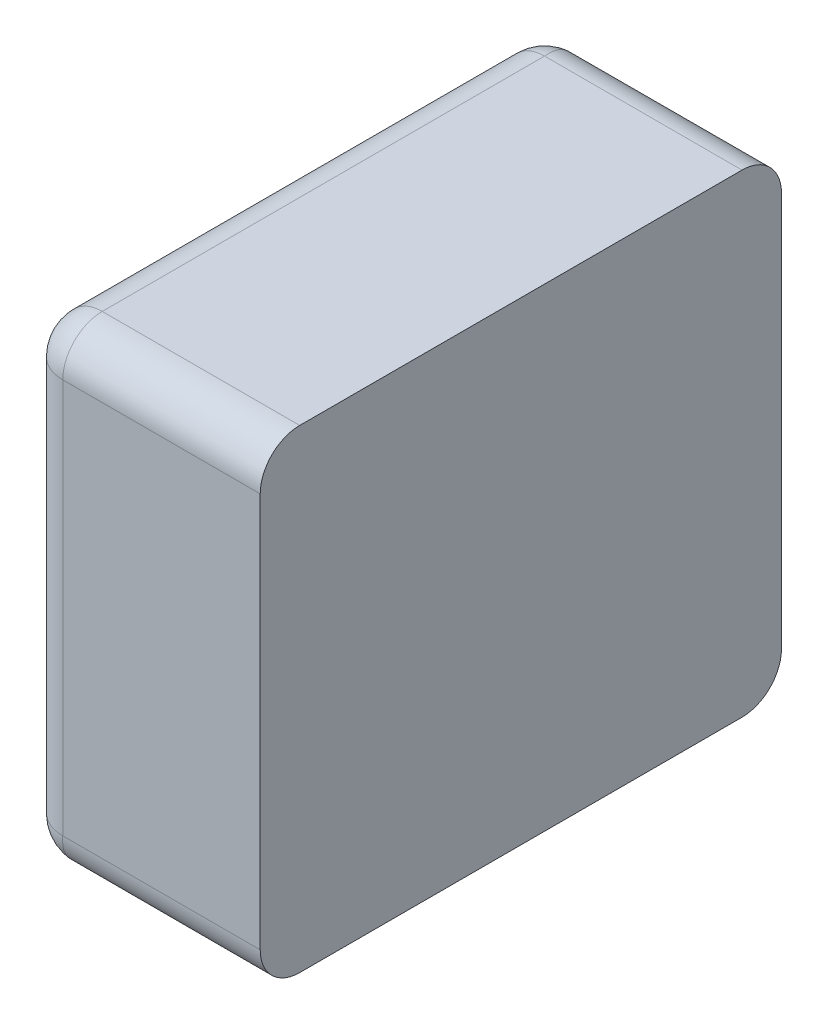
ISO-10303-21;
HEADER;
FILE_DESCRIPTION(('STEP AP214'),'2;1');
FILE_NAME('part.step','',(''),(''),'','','');
FILE_SCHEMA(('AUTOMOTIVE_DESIGN { 1 0 10303 214 1 1 1 1 }'));
ENDSEC;
DATA;
#1=APPLICATION_CONTEXT('core data for automotive mechanical design processes');
#2=APPLICATION_PROTOCOL_DEFINITION('international standard','automotive_design',2000,#1);
#3=PRODUCT_CONTEXT('',#1,'mechanical');
#4=PRODUCT('Part','Part','',(#3));
#5=PRODUCT_RELATED_PRODUCT_CATEGORY('part','',(#4));
#6=PRODUCT_DEFINITION_FORMATION('','',#4);
#7=PRODUCT_DEFINITION_CONTEXT('part definition',#1,'design');
#8=PRODUCT_DEFINITION('design','',#6,#7);
#9=PRODUCT_DEFINITION_SHAPE('','',#8);
#10=(LENGTH_UNIT() NAMED_UNIT(*) SI_UNIT(.MILLI.,.METRE.));
#11=(NAMED_UNIT(*) PLANE_ANGLE_UNIT() SI_UNIT($,.RADIAN.));
#12=(NAMED_UNIT(*) SI_UNIT($,.STERADIAN.) SOLID_ANGLE_UNIT());
#13=UNCERTAINTY_MEASURE_WITH_UNIT(LENGTH_MEASURE(1.E-05),#10,'distance_accuracy_value','');
#14=(GEOMETRIC_REPRESENTATION_CONTEXT(3) GLOBAL_UNCERTAINTY_ASSIGNED_CONTEXT((#13)) GLOBAL_UNIT_ASSIGNED_CONTEXT((#10,
#11,#12)) REPRESENTATION_CONTEXT('',''));
#15=CARTESIAN_POINT('',(0.,0.,0.));
#16=DIRECTION('',(0.,0.,1.));
#17=DIRECTION('',(1.,0.,0.));
#18=AXIS2_PLACEMENT_3D('',#15,#16,#17);
#19=CARTESIAN_POINT('',(-0.275,-0.125,0.025));
#20=DIRECTION('',(-0.816496580927726,0.408248290463864,0.408248290463863));
#21=DIRECTION('',(-0.577350269189626,-0.577350269189627,-0.577350269189625));
#22=AXIS2_PLACEMENT_3D('',#19,#20,#21);
#23=SPHERICAL_SURFACE('',#22,0.025);
#24=CARTESIAN_POINT('',(-0.275,-0.15,0.025));
#25=CARTESIAN_POINT('',(-0.275415676213834,-0.150000010156983,0.0249717616795592));
#26=CARTESIAN_POINT('',(-0.275831055562414,-0.149989585658774,0.0249394158442217));
#27=CARTESIAN_POINT('',(-0.276662012124376,-0.149947847782519,0.0248673044021885));
#28=CARTESIAN_POINT('',(-0.277077581785769,-0.149916440434029,0.0248275059992804));
#29=CARTESIAN_POINT('',(-0.277907618053038,-0.149832548789631,0.0247413826641783));
#30=CARTESIAN_POINT('',(-0.278322073397476,-0.149779979751279,0.0246950319833321));
#31=CARTESIAN_POINT('',(-0.279148608322681,-0.149653686199178,0.0245967395916468));
#32=CARTESIAN_POINT('',(-0.27956067417861,-0.149579886981704,0.0245447785498749));
#33=CARTESIAN_POINT('',(-0.280381173624576,-0.149411146196174,0.0244362356235691));
#34=CARTESIAN_POINT('',(-0.280789592213412,-0.149316140529283,0.0243796400661957));
#35=CARTESIAN_POINT('',(-0.281601566008371,-0.149105097640512,0.0242628279116871));
#36=CARTESIAN_POINT('',(-0.282005106135568,-0.148989007342185,0.0242026024385734));
#37=CARTESIAN_POINT('',(-0.282806120583724,-0.148736002631376,0.0240795539022123));
#38=CARTESIAN_POINT('',(-0.28320358092159,-0.148599046407018,0.0240167258120374));
#39=CARTESIAN_POINT('',(-0.283991266766944,-0.148304614200733,0.0238895132254628));
#40=CARTESIAN_POINT('',(-0.284381480526085,-0.14814710774299,0.023825126535522));
#41=CARTESIAN_POINT('',(-0.285153541708901,-0.14781197565844,0.0236958495945734));
#42=CARTESIAN_POINT('',(-0.285535380708937,-0.147634330792106,0.0236309589181388));
#43=CARTESIAN_POINT('',(-0.286289602430892,-0.147259417678732,0.0235017323758004));
#44=CARTESIAN_POINT('',(-0.286661981083052,-0.147062141159939,0.0234373967562814));
#45=CARTESIAN_POINT('',(-0.287396237536021,-0.146648554189678,0.0233103380435141));
#46=CARTESIAN_POINT('',(-0.287758116578225,-0.146432246000668,0.0232476147597361));
#47=CARTESIAN_POINT('',(-0.288470378199732,-0.145981276798632,0.0231248315859255));
#48=CARTESIAN_POINT('',(-0.288820768206836,-0.145746627988922,0.0230647699658976));
#49=CARTESIAN_POINT('',(-0.289509108460251,-0.14525974785284,0.0229483479675545));
#50=CARTESIAN_POINT('',(-0.289847073104693,-0.14500753792424,0.0228919832419115));
#51=CARTESIAN_POINT('',(-0.290509674749009,-0.144486392144794,0.0227839737435128));
#52=CARTESIAN_POINT('',(-0.290834333801393,-0.144217485995022,0.0227323209712611));
#53=CARTESIAN_POINT('',(-0.291469494627518,-0.143663887304665,0.0226347289227604));
#54=CARTESIAN_POINT('',(-0.291780026684489,-0.143379231742463,0.0225887770211462));
#55=CARTESIAN_POINT('',(-0.292386164695101,-0.142795152921738,0.0225035491754646));
#56=CARTESIAN_POINT('',(-0.29268180962415,-0.14249577276969,0.0224642550853625));
#57=CARTESIAN_POINT('',(-0.293257467637576,-0.141883338445124,0.0223932684780205));
#58=CARTESIAN_POINT('',(-0.293537528729595,-0.14157033224817,0.0223615514954871));
#59=CARTESIAN_POINT('',(-0.294081378390888,-0.14093180991951,0.0223066022870233));
#60=CARTESIAN_POINT('',(-0.294345224212838,-0.140606345279047,0.0222833385908709));
#61=CARTESIAN_POINT('',(-0.294856069398077,-0.139944135618163,0.0222461313306608));
#62=CARTESIAN_POINT('',(-0.295103135339482,-0.139607444174292,0.022232148734625));
#63=CARTESIAN_POINT('',(-0.295579914942669,-0.138924070639427,0.0222142861032459));
#64=CARTESIAN_POINT('',(-0.295809704451679,-0.138577442722618,0.0222103590610882));
#65=CARTESIAN_POINT('',(-0.296251494545238,-0.137875540543628,0.0222133321433696));
#66=CARTESIAN_POINT('',(-0.296463580049632,-0.137520319530238,0.0222201770304482));
#67=CARTESIAN_POINT('',(-0.296869595417803,-0.136802624092122,0.0222453561781187));
#68=CARTESIAN_POINT('',(-0.297063618935002,-0.136440200456916,0.0222636268844006));
#69=CARTESIAN_POINT('',(-0.297433213963008,-0.135709535228763,0.0223122531890844));
#70=CARTESIAN_POINT('',(-0.297608887378239,-0.135341340447619,0.0223425370092373));
#71=CARTESIAN_POINT('',(-0.297941556355398,-0.134600604173974,0.0224157145335039));
#72=CARTESIAN_POINT('',(-0.298098661446718,-0.134228104043934,0.0224585285146415));
#73=CARTESIAN_POINT('',(-0.298394038077466,-0.133480258519227,0.0225572169437126));
#74=CARTESIAN_POINT('',(-0.298532426005439,-0.133104947635931,0.0226130041963119));
#75=CARTESIAN_POINT('',(-0.298790282913471,-0.132353001463475,0.0227380133503036));
#76=CARTESIAN_POINT('',(-0.298909874234575,-0.131976392569098,0.0228071412404509));
#77=CARTESIAN_POINT('',(-0.299130119595873,-0.131223398192717,0.0229591223007916));
#78=CARTESIAN_POINT('',(-0.299230900910104,-0.130847029768722,0.0230418755188332));
#79=CARTESIAN_POINT('',(-0.299413582847159,-0.130096030213761,0.0232213281368203));
#80=CARTESIAN_POINT('',(-0.299495614474251,-0.129721406146137,0.0233179225843271));
#81=CARTESIAN_POINT('',(-0.299604779367685,-0.12916097275375,0.0234736338151954));
#82=CARTESIAN_POINT('',(-0.299638780077472,-0.128974916302159,0.0235271805591116));
#83=CARTESIAN_POINT('',(-0.29970212944545,-0.128603818714183,0.0236377844166513));
#84=CARTESIAN_POINT('',(-0.29973149488389,-0.128418776370976,0.0236948277794382));
#85=CARTESIAN_POINT('',(-0.299785596680384,-0.12804990634783,0.0238124252593363));
#86=CARTESIAN_POINT('',(-0.299810349876557,-0.127866076710932,0.023872965505361));
#87=CARTESIAN_POINT('',(-0.299855256493048,-0.12749982091122,0.0239975539979947));
#88=CARTESIAN_POINT('',(-0.299875426755908,-0.127317392070842,0.0240615882907726));
#89=CARTESIAN_POINT('',(-0.299911199948112,-0.126954128152848,0.0241931561571548));
#90=CARTESIAN_POINT('',(-0.299926819681761,-0.126773289666063,0.0242606757436093));
#91=CARTESIAN_POINT('',(-0.299953528249625,-0.126413394821305,0.0243992001051096));
#92=CARTESIAN_POINT('',(-0.299964633803205,-0.126234334328419,0.0244701909080881));
#93=CARTESIAN_POINT('',(-0.299982353760455,-0.125878182225797,0.0246156386140871));
#94=CARTESIAN_POINT('',(-0.299988984753714,-0.125701085764511,0.0246900816080177));
#95=CARTESIAN_POINT('',(-0.299997800037759,-0.125349047666083,0.0248424075130586));
#96=CARTESIAN_POINT('',(-0.300000000737951,-0.125174100471466,0.0249202766343398));
#97=CARTESIAN_POINT('',(-0.3,-0.125,0.025));
#98=B_SPLINE_CURVE_WITH_KNOTS('',3,(#24,#25,#26,#27,#28,#29,#30,#31,#32,#33,#34,#35,#36,#37,#38,
#39,#40,#41,#42,#43,#44,#45,#46,#47,#48,#49,#50,#51,#52,#53,#54,#55,#56,#57,#58,#59,#60,#61,#62,
#63,#64,#65,#66,#67,#68,#69,#70,#71,#72,#73,#74,#75,#76,#77,#78,#79,#80,#81,#82,#83,#84,#85,#86,
#87,#88,#89,#90,#91,#92,#93,#94,#95,#96,#97),.UNSPECIFIED.,.F.,.F.,(4,2,2,2,2,2,2,2,2,2,2,2,2,2,
2,2,2,2,2,2,2,2,2,2,2,2,2,2,2,2,2,2,2,2,2,2,4),(0.,0.00124972674914432,0.00250508818118087,
0.00376552755498708,0.00503045751811205,0.00629926393006435,0.00757130973543098,
0.00884593887638394,0.0101224802356455,0.0114002516022038,0.0126785636530195,0.0139567239446433,
0.0152340409091005,0.0165098278485827,0.0177834069234384,0.0190541131276553,0.0203212982454897,
0.0215843347821013,0.0228426198599832,0.0240955790716335,0.0253426702772639,0.0265833873343772,
0.0278172637437544,0.0290438761937642,0.0302628479819392,0.0314738522894821,0.0326766152807867,
0.0338709189962571,0.0350566040027588,0.0356462463463342,0.0362337025741548,0.0368189702268576,
0.0374020508853401,0.0379829502134117,0.0385616779934515,0.0391382481546671,0.0397126787935412),.UNSPECIFIED.);
#99=CARTESIAN_POINT('',(-0.275,-0.15,0.025));
#100=VERTEX_POINT('',#99);
#101=CARTESIAN_POINT('',(-0.3,-0.125,0.025));
#102=VERTEX_POINT('',#101);
#103=EDGE_CURVE('E11',#100,#102,#98,.T.);
#104=ORIENTED_EDGE('',*,*,#103,.T.);
#105=CARTESIAN_POINT('',(-0.275,-0.125,0.025));
#106=DIRECTION('',(0.,-1.,0.));
#107=DIRECTION('',(0.,0.,-1.));
#108=AXIS2_PLACEMENT_3D('',#105,#106,#107);
#109=CIRCLE('',#108,0.025);
#110=CARTESIAN_POINT('',(-0.275,-0.125,0.));
#111=VERTEX_POINT('',#110);
#112=EDGE_CURVE('E25',#102,#111,#109,.T.);
#113=ORIENTED_EDGE('',*,*,#112,.T.);
#114=CARTESIAN_POINT('',(-0.275,-0.125,0.025));
#115=DIRECTION('',(-1.,0.,0.));
#116=DIRECTION('',(0.,-1.,0.));
#117=AXIS2_PLACEMENT_3D('',#114,#115,#116);
#118=CIRCLE('',#117,0.025);
#119=EDGE_CURVE('E109',#111,#100,#118,.T.);
#120=ORIENTED_EDGE('',*,*,#119,.T.);
#121=EDGE_LOOP('',(#104,#113,#120));
#122=FACE_BOUND('',#121,.T.);
#123=ADVANCED_FACE('F17',(#122),#23,.T.);
#124=CARTESIAN_POINT('',(-0.275,0.125,0.025));
#125=DIRECTION('',(0.408248290463864,-0.408248290463863,-0.816496580927726));
#126=DIRECTION('',(-0.577350269189627,0.577350269189625,-0.577350269189626));
#127=AXIS2_PLACEMENT_3D('',#124,#125,#126);
#128=SPHERICAL_SURFACE('',#127,0.025);
#129=CARTESIAN_POINT('',(-0.275,0.125,0.025));
#130=DIRECTION('',(0.,0.,-1.));
#131=DIRECTION('',(0.,1.,0.));
#132=AXIS2_PLACEMENT_3D('',#129,#130,#131);
#133=CIRCLE('',#132,0.025);
#134=CARTESIAN_POINT('',(-0.3,0.125,0.025));
#135=VERTEX_POINT('',#134);
#136=CARTESIAN_POINT('',(-0.275,0.15,0.025));
#137=VERTEX_POINT('',#136);
#138=EDGE_CURVE('E227',#135,#137,#133,.T.);
#139=ORIENTED_EDGE('',*,*,#138,.T.);
#140=CARTESIAN_POINT('',(-0.275,0.15,0.025));
#141=CARTESIAN_POINT('',(-0.275028238320441,0.150000010156983,0.0245843237861664));
#142=CARTESIAN_POINT('',(-0.275060584155778,0.149989585658774,0.0241689444375859));
#143=CARTESIAN_POINT('',(-0.275132695597812,0.149947847782519,0.0233379878756242));
#144=CARTESIAN_POINT('',(-0.27517249400072,0.149916440434029,0.0229224182142309));
#145=CARTESIAN_POINT('',(-0.275258617335822,0.149832548789631,0.0220923819469617));
#146=CARTESIAN_POINT('',(-0.275304968016668,0.149779979751279,0.0216779266025236));
#147=CARTESIAN_POINT('',(-0.275403260408353,0.149653686199178,0.0208513916773187));
#148=CARTESIAN_POINT('',(-0.275455221450125,0.149579886981704,0.0204393258213897));
#149=CARTESIAN_POINT('',(-0.275563764376431,0.149411146196174,0.0196188263754239));
#150=CARTESIAN_POINT('',(-0.275620359933804,0.149316140529283,0.0192104077865878));
#151=CARTESIAN_POINT('',(-0.275737172088313,0.149105097640512,0.0183984339916287));
#152=CARTESIAN_POINT('',(-0.275797397561427,0.148989007342185,0.0179948938644317));
#153=CARTESIAN_POINT('',(-0.275920446097788,0.148736002631376,0.0171938794162764));
#154=CARTESIAN_POINT('',(-0.275983274187963,0.148599046407018,0.0167964190784103));
#155=CARTESIAN_POINT('',(-0.276110486774537,0.148304614200733,0.0160087332330562));
#156=CARTESIAN_POINT('',(-0.276174873464478,0.14814710774299,0.0156185194739151));
#157=CARTESIAN_POINT('',(-0.276304150405427,0.14781197565844,0.0148464582910993));
#158=CARTESIAN_POINT('',(-0.276369041081861,0.147634330792106,0.0144646192910634));
#159=CARTESIAN_POINT('',(-0.2764982676242,0.147259417678732,0.0137103975691083));
#160=CARTESIAN_POINT('',(-0.276562603243719,0.147062141159939,0.013338018916948));
#161=CARTESIAN_POINT('',(-0.276689661956486,0.146648554189678,0.0126037624639793));
#162=CARTESIAN_POINT('',(-0.276752385240264,0.146432246000668,0.0122418834217749));
#163=CARTESIAN_POINT('',(-0.276875168414075,0.145981276798632,0.0115296218002681));
#164=CARTESIAN_POINT('',(-0.276935230034102,0.145746627988922,0.0111792317931642));
#165=CARTESIAN_POINT('',(-0.277051652032446,0.14525974785284,0.0104908915397485));
#166=CARTESIAN_POINT('',(-0.277108016758089,0.14500753792424,0.0101529268953074));
#167=CARTESIAN_POINT('',(-0.277216026256487,0.144486392144794,0.00949032525099112));
#168=CARTESIAN_POINT('',(-0.277267679028739,0.144217485995022,0.00916566619860705));
#169=CARTESIAN_POINT('',(-0.27736527107724,0.143663887304665,0.00853050537248187));
#170=CARTESIAN_POINT('',(-0.277411222978854,0.143379231742463,0.00821997331551061));
#171=CARTESIAN_POINT('',(-0.277496450824535,0.142795152921738,0.00761383530489926));
#172=CARTESIAN_POINT('',(-0.277535744914638,0.14249577276969,0.0073181903758499));
#173=CARTESIAN_POINT('',(-0.27760673152198,0.141883338445124,0.00674253236242435));
#174=CARTESIAN_POINT('',(-0.277638448504513,0.14157033224817,0.00646247127040547));
#175=CARTESIAN_POINT('',(-0.277693397712977,0.14093180991951,0.00591862160911195));
#176=CARTESIAN_POINT('',(-0.277716661409129,0.140606345279047,0.00565477578716186));
#177=CARTESIAN_POINT('',(-0.277753868669339,0.139944135618163,0.00514393060192284));
#178=CARTESIAN_POINT('',(-0.277767851265375,0.139607444174292,0.00489686466051837));
#179=CARTESIAN_POINT('',(-0.277785713896754,0.138924070639427,0.00442008505733056));
#180=CARTESIAN_POINT('',(-0.277789640938912,0.138577442722617,0.00419029554832144));
#181=CARTESIAN_POINT('',(-0.27778666785663,0.137875540543628,0.00374850545476184));
#182=CARTESIAN_POINT('',(-0.277779822969552,0.137520319530238,0.00353641995036835));
#183=CARTESIAN_POINT('',(-0.277754643821881,0.136802624092122,0.00313040458219718));
#184=CARTESIAN_POINT('',(-0.277736373115599,0.136440200456916,0.00293638106499816));
#185=CARTESIAN_POINT('',(-0.277687746810916,0.135709535228763,0.00256678603699146));
#186=CARTESIAN_POINT('',(-0.277657462990763,0.135341340447619,0.00239111262176079));
#187=CARTESIAN_POINT('',(-0.277584285466496,0.134600604173974,0.00205844364460159));
#188=CARTESIAN_POINT('',(-0.277541471485359,0.134228104043934,0.00190133855328219));
#189=CARTESIAN_POINT('',(-0.277442783056288,0.133480258519227,0.00160596192253449));
#190=CARTESIAN_POINT('',(-0.277386995803688,0.133104947635931,0.00146757399456146));
#191=CARTESIAN_POINT('',(-0.277261986649696,0.132353001463475,0.00120971708652909));
#192=CARTESIAN_POINT('',(-0.277192858759549,0.131976392569098,0.00109012576542486));
#193=CARTESIAN_POINT('',(-0.277040877699208,0.131223398192717,0.000869880404126535));
#194=CARTESIAN_POINT('',(-0.276958124481167,0.130847029768722,0.000769099089895567));
#195=CARTESIAN_POINT('',(-0.27677867186318,0.130096030213761,0.000586417152841505));
#196=CARTESIAN_POINT('',(-0.276682077415673,0.129721406146137,0.00050438552574881));
#197=CARTESIAN_POINT('',(-0.276526366184805,0.12916097275375,0.000395220632315162));
#198=CARTESIAN_POINT('',(-0.276472819440888,0.128974916302159,0.000361219922528354));
#199=CARTESIAN_POINT('',(-0.276362215583349,0.128603818714183,0.000297870554549847));
#200=CARTESIAN_POINT('',(-0.276305172220562,0.128418776370976,0.000268505116110418));
#201=CARTESIAN_POINT('',(-0.276187574740664,0.12804990634783,0.00021440331961602));
#202=CARTESIAN_POINT('',(-0.276127034494639,0.127866076710932,0.000189650123443174));
#203=CARTESIAN_POINT('',(-0.276002446002005,0.12749982091122,0.000144743506951797));
#204=CARTESIAN_POINT('',(-0.275938411709227,0.127317392070842,0.00012457324409247));
#205=CARTESIAN_POINT('',(-0.275806843842845,0.126954128152848,8.8800051888205E-05));
#206=CARTESIAN_POINT('',(-0.275739324256391,0.126773289666063,7.3180318238639E-05));
#207=CARTESIAN_POINT('',(-0.27560079989489,0.126413394821305,4.64717503746717E-05));
#208=CARTESIAN_POINT('',(-0.275529809091912,0.126234334328419,3.5366196795129E-05));
#209=CARTESIAN_POINT('',(-0.275384361385913,0.125878182225797,1.76462395452149E-05));
#210=CARTESIAN_POINT('',(-0.275309918391982,0.125701085764511,1.10152462860655E-05));
#211=CARTESIAN_POINT('',(-0.275157592486941,0.125349047666083,2.19996224107495E-06));
#212=CARTESIAN_POINT('',(-0.27507972336566,0.125174100471466,-7.3795088351577E-10));
#213=CARTESIAN_POINT('',(-0.275,0.125,0.));
#214=B_SPLINE_CURVE_WITH_KNOTS('',3,(#140,#141,#142,#143,#144,#145,#146,#147,#148,#149,#150,
#151,#152,#153,#154,#155,#156,#157,#158,#159,#160,#161,#162,#163,#164,#165,#166,#167,#168,#169,
#170,#171,#172,#173,#174,#175,#176,#177,#178,#179,#180,#181,#182,#183,#184,#185,#186,#187,#188,
#189,#190,#191,#192,#193,#194,#195,#196,#197,#198,#199,#200,#201,#202,#203,#204,#205,#206,#207,
#208,#209,#210,#211,#212,#213),.UNSPECIFIED.,.F.,.F.,(4,2,2,2,2,2,2,2,2,2,2,2,2,2,2,2,2,2,2,2,2,
2,2,2,2,2,2,2,2,2,2,2,2,2,2,2,4),(0.,0.00124972674914428,0.00250508818118087,
0.00376552755498708,0.00503045751811209,0.00629926393006442,0.00757130973543103,
0.008845938876384,0.0101224802356455,0.0114002516022038,0.0126785636530195,0.0139567239446434,
0.0152340409091005,0.0165098278485827,0.0177834069234385,0.0190541131276553,0.0203212982454898,
0.0215843347821014,0.0228426198599832,0.0240955790716335,0.025342670277264,0.0265833873343772,
0.0278172637437544,0.0290438761937642,0.0302628479819393,0.0314738522894822,0.0326766152807867,
0.0338709189962572,0.0350566040027589,0.0356462463463343,0.0362337025741548,0.0368189702268576,
0.0374020508853402,0.0379829502134118,0.0385616779934515,0.0391382481546671,0.0397126787935412),.UNSPECIFIED.);
#215=CARTESIAN_POINT('',(-0.275,0.125,0.));
#216=VERTEX_POINT('',#215);
#217=EDGE_CURVE('E231',#137,#216,#214,.T.);
#218=ORIENTED_EDGE('',*,*,#217,.T.);
#219=CARTESIAN_POINT('',(-0.275,0.125,0.025));
#220=DIRECTION('',(0.,1.,0.));
#221=DIRECTION('',(-1.,0.,0.));
#222=AXIS2_PLACEMENT_3D('',#219,#220,#221);
#223=CIRCLE('',#222,0.025);
#224=EDGE_CURVE('E260',#216,#135,#223,.T.);
#225=ORIENTED_EDGE('',*,*,#224,.T.);
#226=EDGE_LOOP('',(#139,#218,#225));
#227=FACE_BOUND('',#226,.T.);
#228=ADVANCED_FACE('F243',(#227),#128,.T.);
#229=CARTESIAN_POINT('',(-0.1875,0.125,0.025));
#230=DIRECTION('',(-1.,0.,0.));
#231=DIRECTION('',(0.,0.707106781186548,-0.707106781186547));
#232=AXIS2_PLACEMENT_3D('',#229,#230,#231);
#233=CYLINDRICAL_SURFACE('',#232,0.025);
#234=CARTESIAN_POINT('',(-0.15,0.125,0.025));
#235=DIRECTION('',(-1.,0.,0.));
#236=DIRECTION('',(0.,0.707106781186548,-0.707106781186547));
#237=AXIS2_PLACEMENT_3D('',#234,#235,#236);
#238=CIRCLE('',#237,0.025);
#239=CARTESIAN_POINT('',(-0.15,0.15,0.025));
#240=VERTEX_POINT('',#239);
#241=CARTESIAN_POINT('',(-0.15,0.125,0.));
#242=VERTEX_POINT('',#241);
#243=EDGE_CURVE('E267',#240,#242,#238,.T.);
#244=ORIENTED_EDGE('',*,*,#243,.T.);
#245=DIRECTION('',(-1.,0.,0.));
#246=VECTOR('',#245,1.);
#247=CARTESIAN_POINT('',(-0.1875,0.125,0.));
#248=LINE('',#247,#246);
#249=EDGE_CURVE('E118',#242,#216,#248,.T.);
#250=ORIENTED_EDGE('',*,*,#249,.T.);
#251=ORIENTED_EDGE('',*,*,#217,.F.);
#252=DIRECTION('',(1.,0.,0.));
#253=VECTOR('',#252,1.);
#254=CARTESIAN_POINT('',(-0.1875,0.15,0.025));
#255=LINE('',#254,#253);
#256=EDGE_CURVE('E272',#137,#240,#255,.T.);
#257=ORIENTED_EDGE('',*,*,#256,.T.);
#258=EDGE_LOOP('',(#244,#250,#251,#257));
#259=FACE_BOUND('',#258,.T.);
#260=ADVANCED_FACE('F252',(#259),#233,.T.);
#261=CARTESIAN_POINT('',(-0.275,0.0749999999999998,0.025));
#262=DIRECTION('',(0.,-1.,0.));
#263=DIRECTION('',(-0.707106781186548,0.,-0.707106781186547));
#264=AXIS2_PLACEMENT_3D('',#261,#262,#263);
#265=CYLINDRICAL_SURFACE('',#264,0.025);
#266=ORIENTED_EDGE('',*,*,#112,.F.);
#267=DIRECTION('',(0.,1.,0.));
#268=VECTOR('',#267,1.);
#269=CARTESIAN_POINT('',(-0.3,0.0749999999999998,0.025));
#270=LINE('',#269,#268);
#271=EDGE_CURVE('E277',#102,#135,#270,.T.);
#272=ORIENTED_EDGE('',*,*,#271,.T.);
#273=ORIENTED_EDGE('',*,*,#224,.F.);
#274=DIRECTION('',(0.,-1.,0.));
#275=VECTOR('',#274,1.);
#276=CARTESIAN_POINT('',(-0.275,0.0749999999999998,0.));
#277=LINE('',#276,#275);
#278=EDGE_CURVE('E282',#216,#111,#277,.T.);
#279=ORIENTED_EDGE('',*,*,#278,.T.);
#280=EDGE_LOOP('',(#266,#272,#273,#279));
#281=FACE_BOUND('',#280,.T.);
#282=ADVANCED_FACE('F255',(#281),#265,.T.);
#283=CARTESIAN_POINT('',(-0.275,-0.125,0.305));
#284=DIRECTION('',(0.408248290463862,-0.816496580927727,-0.408248290463862));
#285=DIRECTION('',(-0.577350269189627,-0.577350269189624,0.577350269189627));
#286=AXIS2_PLACEMENT_3D('',#283,#284,#285);
#287=SPHERICAL_SURFACE('',#286,0.025);
#288=CARTESIAN_POINT('',(-0.275,-0.125,0.305));
#289=DIRECTION('',(0.,-1.,0.));
#290=DIRECTION('',(-1.,0.,0.));
#291=AXIS2_PLACEMENT_3D('',#288,#289,#290);
#292=CIRCLE('',#291,0.025);
#293=CARTESIAN_POINT('',(-0.275,-0.125,0.33));
#294=VERTEX_POINT('',#293);
#295=CARTESIAN_POINT('',(-0.3,-0.125,0.305));
#296=VERTEX_POINT('',#295);
#297=EDGE_CURVE('E286',#294,#296,#292,.T.);
#298=ORIENTED_EDGE('',*,*,#297,.T.);
#299=CARTESIAN_POINT('',(-0.275,-0.125,0.305));
#300=DIRECTION('',(0.,0.,1.));
#301=DIRECTION('',(0.,-1.,0.));
#302=AXIS2_PLACEMENT_3D('',#299,#300,#301);
#303=CIRCLE('',#302,0.025);
#304=CARTESIAN_POINT('',(-0.275,-0.15,0.305));
#305=VERTEX_POINT('',#304);
#306=EDGE_CURVE('E290',#296,#305,#303,.T.);
#307=ORIENTED_EDGE('',*,*,#306,.T.);
#308=CARTESIAN_POINT('',(-0.275,-0.15,0.305));
#309=CARTESIAN_POINT('',(-0.27507972336566,-0.150000000737951,0.305174100471466));
#310=CARTESIAN_POINT('',(-0.275157592486941,-0.149997800037759,0.305349047666083));
#311=CARTESIAN_POINT('',(-0.275309918391982,-0.149988984753714,0.30570108576451));
#312=CARTESIAN_POINT('',(-0.275384361385913,-0.149982353760455,0.305878182225797));
#313=CARTESIAN_POINT('',(-0.275529809091912,-0.149964633803205,0.306234334328419));
#314=CARTESIAN_POINT('',(-0.27560079989489,-0.149953528249625,0.306413394821305));
#315=CARTESIAN_POINT('',(-0.275739324256391,-0.149926819681761,0.306773289666062));
#316=CARTESIAN_POINT('',(-0.275806843842845,-0.149911199948112,0.306954128152848));
#317=CARTESIAN_POINT('',(-0.275938411709227,-0.149875426755908,0.307317392070842));
#318=CARTESIAN_POINT('',(-0.276002446002005,-0.149855256493048,0.30749982091122));
#319=CARTESIAN_POINT('',(-0.276127034494639,-0.149810349876557,0.307866076710932));
#320=CARTESIAN_POINT('',(-0.276187574740664,-0.149785596680384,0.30804990634783));
#321=CARTESIAN_POINT('',(-0.276305172220562,-0.14973149488389,0.308418776370976));
#322=CARTESIAN_POINT('',(-0.276362215583349,-0.14970212944545,0.308603818714183));
#323=CARTESIAN_POINT('',(-0.276472819440888,-0.149638780077472,0.308974916302159));
#324=CARTESIAN_POINT('',(-0.276526366184805,-0.149604779367685,0.30916097275375));
#325=CARTESIAN_POINT('',(-0.276682077415673,-0.149495614474251,0.309721406146137));
#326=CARTESIAN_POINT('',(-0.27677867186318,-0.149413582847159,0.310096030213761));
#327=CARTESIAN_POINT('',(-0.276958124481167,-0.149230900910104,0.310847029768722));
#328=CARTESIAN_POINT('',(-0.277040877699208,-0.149130119595873,0.311223398192717));
#329=CARTESIAN_POINT('',(-0.277192858759549,-0.148909874234575,0.311976392569098));
#330=CARTESIAN_POINT('',(-0.277261986649696,-0.148790282913471,0.312353001463475));
#331=CARTESIAN_POINT('',(-0.277386995803688,-0.148532426005439,0.313104947635931));
#332=CARTESIAN_POINT('',(-0.277442783056288,-0.148394038077466,0.313480258519227));
#333=CARTESIAN_POINT('',(-0.277541471485359,-0.148098661446718,0.314228104043934));
#334=CARTESIAN_POINT('',(-0.277584285466496,-0.147941556355398,0.314600604173974));
#335=CARTESIAN_POINT('',(-0.277657462990763,-0.147608887378239,0.315341340447619));
#336=CARTESIAN_POINT('',(-0.277687746810916,-0.147433213963009,0.315709535228763));
#337=CARTESIAN_POINT('',(-0.277736373115599,-0.147063618935002,0.316440200456916));
#338=CARTESIAN_POINT('',(-0.277754643821881,-0.146869595417803,0.316802624092122));
#339=CARTESIAN_POINT('',(-0.277779822969552,-0.146463580049632,0.317520319530238));
#340=CARTESIAN_POINT('',(-0.27778666785663,-0.146251494545238,0.317875540543628));
#341=CARTESIAN_POINT('',(-0.277789640938912,-0.145809704451679,0.318577442722617));
#342=CARTESIAN_POINT('',(-0.277785713896754,-0.145579914942669,0.318924070639427));
#343=CARTESIAN_POINT('',(-0.277767851265375,-0.145103135339482,0.319607444174292));
#344=CARTESIAN_POINT('',(-0.277753868669339,-0.144856069398077,0.319944135618163));
#345=CARTESIAN_POINT('',(-0.277716661409129,-0.144345224212838,0.320606345279046));
#346=CARTESIAN_POINT('',(-0.277693397712977,-0.144081378390888,0.32093180991951));
#347=CARTESIAN_POINT('',(-0.277638448504513,-0.143537528729595,0.32157033224817));
#348=CARTESIAN_POINT('',(-0.27760673152198,-0.143257467637576,0.321883338445124));
#349=CARTESIAN_POINT('',(-0.277535744914638,-0.14268180962415,0.32249577276969));
#350=CARTESIAN_POINT('',(-0.277496450824535,-0.142386164695101,0.322795152921738));
#351=CARTESIAN_POINT('',(-0.277411222978854,-0.141780026684489,0.323379231742463));
#352=CARTESIAN_POINT('',(-0.27736527107724,-0.141469494627518,0.323663887304665));
#353=CARTESIAN_POINT('',(-0.277267679028739,-0.140834333801393,0.324217485995022));
#354=CARTESIAN_POINT('',(-0.277216026256487,-0.140509674749009,0.324486392144794));
#355=CARTESIAN_POINT('',(-0.277108016758089,-0.139847073104693,0.32500753792424));
#356=CARTESIAN_POINT('',(-0.277051652032446,-0.139509108460252,0.32525974785284));
#357=CARTESIAN_POINT('',(-0.276935230034102,-0.138820768206836,0.325746627988922));
#358=CARTESIAN_POINT('',(-0.276875168414075,-0.138470378199732,0.325981276798632));
#359=CARTESIAN_POINT('',(-0.276752385240264,-0.137758116578225,0.326432246000668));
#360=CARTESIAN_POINT('',(-0.276689661956486,-0.137396237536021,0.326648554189678));
#361=CARTESIAN_POINT('',(-0.276562603243719,-0.136661981083052,0.327062141159939));
#362=CARTESIAN_POINT('',(-0.2764982676242,-0.136289602430892,0.327259417678732));
#363=CARTESIAN_POINT('',(-0.276369041081861,-0.135535380708937,0.327634330792106));
#364=CARTESIAN_POINT('',(-0.276304150405427,-0.135153541708901,0.32781197565844));
#365=CARTESIAN_POINT('',(-0.276174873464478,-0.134381480526085,0.32814710774299));
#366=CARTESIAN_POINT('',(-0.276110486774537,-0.133991266766944,0.328304614200733));
#367=CARTESIAN_POINT('',(-0.275983274187963,-0.13320358092159,0.328599046407018));
#368=CARTESIAN_POINT('',(-0.275920446097788,-0.132806120583724,0.328736002631376));
#369=CARTESIAN_POINT('',(-0.275797397561427,-0.132005106135568,0.328989007342185));
#370=CARTESIAN_POINT('',(-0.275737172088313,-0.131601566008371,0.329105097640512));
#371=CARTESIAN_POINT('',(-0.275620359933804,-0.130789592213412,0.329316140529283));
#372=CARTESIAN_POINT('',(-0.275563764376431,-0.130381173624576,0.329411146196174));
#373=CARTESIAN_POINT('',(-0.275455221450125,-0.12956067417861,0.329579886981704));
#374=CARTESIAN_POINT('',(-0.275403260408353,-0.129148608322681,0.329653686199178));
#375=CARTESIAN_POINT('',(-0.275304968016668,-0.128322073397476,0.329779979751279));
#376=CARTESIAN_POINT('',(-0.275258617335822,-0.127907618053038,0.329832548789631));
#377=CARTESIAN_POINT('',(-0.27517249400072,-0.127077581785769,0.329916440434029));
#378=CARTESIAN_POINT('',(-0.275132695597812,-0.126662012124376,0.329947847782519));
#379=CARTESIAN_POINT('',(-0.275060584155778,-0.125831055562414,0.329989585658774));
#380=CARTESIAN_POINT('',(-0.275028238320441,-0.125415676213834,0.330000010156983));
#381=CARTESIAN_POINT('',(-0.275,-0.125,0.33));
#382=B_SPLINE_CURVE_WITH_KNOTS('',3,(#308,#309,#310,#311,#312,#313,#314,#315,#316,#317,#318,
#319,#320,#321,#322,#323,#324,#325,#326,#327,#328,#329,#330,#331,#332,#333,#334,#335,#336,#337,
#338,#339,#340,#341,#342,#343,#344,#345,#346,#347,#348,#349,#350,#351,#352,#353,#354,#355,#356,
#357,#358,#359,#360,#361,#362,#363,#364,#365,#366,#367,#368,#369,#370,#371,#372,#373,#374,#375,
#376,#377,#378,#379,#380,#381),.UNSPECIFIED.,.F.,.F.,(4,2,2,2,2,2,2,2,2,2,2,2,2,2,2,2,2,2,2,2,2,
2,2,2,2,2,2,2,2,2,2,2,2,2,2,2,4),(0.,0.000574430638874099,0.00115100080008963,
0.00172972858012942,0.002310627908201,0.00289370856668354,0.00347897621938635,
0.00406643244720693,0.00465607479078235,0.00584175979728405,0.00703606351275453,
0.00823882650405904,0.00944983081160195,0.010668802599777,0.0118954150497868,0.013129291459164,
0.0143700085162772,0.0156170997219077,0.016870058933558,0.0181283440114398,0.0193913805480514,
0.0206585656658859,0.0219292718701028,0.0232028509449585,0.0244786378844407,0.0257559548488978,
0.0270341151405217,0.0283124271913373,0.0295901985578957,0.0308667399171572,0.0321413690581102,
0.0334134148634768,0.0346822212754291,0.0359471512385541,0.0372075906123603,0.0384629520443969,
0.0397126787935412),.UNSPECIFIED.);
#383=EDGE_CURVE('E180',#305,#294,#382,.T.);
#384=ORIENTED_EDGE('',*,*,#383,.T.);
#385=EDGE_LOOP('',(#298,#307,#384));
#386=FACE_BOUND('',#385,.T.);
#387=ADVANCED_FACE('F204',(#386),#287,.T.);
#388=CARTESIAN_POINT('',(-0.275,-0.125,0.));
#389=DIRECTION('',(0.,0.,1.));
#390=DIRECTION('',(-0.707106781186548,-0.707106781186548,0.));
#391=AXIS2_PLACEMENT_3D('',#388,#389,#390);
#392=CYLINDRICAL_SURFACE('',#391,0.025);
#393=ORIENTED_EDGE('',*,*,#306,.F.);
#394=DIRECTION('',(0.,0.,-1.));
#395=VECTOR('',#394,1.);
#396=CARTESIAN_POINT('',(-0.3,-0.125,0.));
#397=LINE('',#396,#395);
#398=EDGE_CURVE('E176',#296,#102,#397,.T.);
#399=ORIENTED_EDGE('',*,*,#398,.T.);
#400=ORIENTED_EDGE('',*,*,#103,.F.);
#401=DIRECTION('',(0.,0.,1.));
#402=VECTOR('',#401,1.);
#403=CARTESIAN_POINT('',(-0.275,-0.15,0.));
#404=LINE('',#403,#402);
#405=EDGE_CURVE('E172',#100,#305,#404,.T.);
#406=ORIENTED_EDGE('',*,*,#405,.T.);
#407=EDGE_LOOP('',(#393,#399,#400,#406));
#408=FACE_BOUND('',#407,.T.);
#409=ADVANCED_FACE('F198',(#408),#392,.T.);
#410=CARTESIAN_POINT('',(-0.2625,-0.125,0.305));
#411=DIRECTION('',(1.,0.,0.));
#412=DIRECTION('',(0.,-0.707106781186547,0.707106781186548));
#413=AXIS2_PLACEMENT_3D('',#410,#411,#412);
#414=CYLINDRICAL_SURFACE('',#413,0.025);
#415=CARTESIAN_POINT('',(-0.15,-0.125,0.305));
#416=DIRECTION('',(-1.,0.,0.));
#417=DIRECTION('',(0.,-0.707106781186547,0.707106781186548));
#418=AXIS2_PLACEMENT_3D('',#415,#416,#417);
#419=CIRCLE('',#418,0.025);
#420=CARTESIAN_POINT('',(-0.15,-0.15,0.305));
#421=VERTEX_POINT('',#420);
#422=CARTESIAN_POINT('',(-0.15,-0.125,0.33));
#423=VERTEX_POINT('',#422);
#424=EDGE_CURVE('E170',#421,#423,#419,.T.);
#425=ORIENTED_EDGE('',*,*,#424,.T.);
#426=DIRECTION('',(-1.,0.,0.));
#427=VECTOR('',#426,1.);
#428=CARTESIAN_POINT('',(-0.2625,-0.125,0.33));
#429=LINE('',#428,#427);
#430=EDGE_CURVE('E165',#423,#294,#429,.T.);
#431=ORIENTED_EDGE('',*,*,#430,.T.);
#432=ORIENTED_EDGE('',*,*,#383,.F.);
#433=DIRECTION('',(1.,0.,0.));
#434=VECTOR('',#433,1.);
#435=CARTESIAN_POINT('',(-0.2625,-0.15,0.305));
#436=LINE('',#435,#434);
#437=EDGE_CURVE('E160',#305,#421,#436,.T.);
#438=ORIENTED_EDGE('',*,*,#437,.T.);
#439=EDGE_LOOP('',(#425,#431,#432,#438));
#440=FACE_BOUND('',#439,.T.);
#441=ADVANCED_FACE('F187',(#440),#414,.T.);
#442=CARTESIAN_POINT('',(-0.275,0.125,0.305));
#443=DIRECTION('',(-0.408248290463862,-0.816496580927727,0.408248290463862));
#444=DIRECTION('',(-0.577350269189627,0.577350269189624,0.577350269189627));
#445=AXIS2_PLACEMENT_3D('',#442,#443,#444);
#446=SPHERICAL_SURFACE('',#445,0.025);
#447=CARTESIAN_POINT('',(-0.275,0.125,0.305));
#448=DIRECTION('',(-1.,0.,0.));
#449=DIRECTION('',(0.,1.,0.));
#450=AXIS2_PLACEMENT_3D('',#447,#448,#449);
#451=CIRCLE('',#450,0.025);
#452=CARTESIAN_POINT('',(-0.275,0.125,0.33));
#453=VERTEX_POINT('',#452);
#454=CARTESIAN_POINT('',(-0.275,0.15,0.305));
#455=VERTEX_POINT('',#454);
#456=EDGE_CURVE('E158',#453,#455,#451,.T.);
#457=ORIENTED_EDGE('',*,*,#456,.T.);
#458=CARTESIAN_POINT('',(-0.275,0.125,0.305));
#459=DIRECTION('',(0.,0.,1.));
#460=DIRECTION('',(-1.,0.,0.));
#461=AXIS2_PLACEMENT_3D('',#458,#459,#460);
#462=CIRCLE('',#461,0.025);
#463=CARTESIAN_POINT('',(-0.3,0.125,0.305));
#464=VERTEX_POINT('',#463);
#465=EDGE_CURVE('E156',#455,#464,#462,.T.);
#466=ORIENTED_EDGE('',*,*,#465,.T.);
#467=CARTESIAN_POINT('',(-0.275,0.125,0.305));
#468=DIRECTION('',(0.,1.,0.));
#469=DIRECTION('',(0.,0.,1.));
#470=AXIS2_PLACEMENT_3D('',#467,#468,#469);
#471=CIRCLE('',#470,0.025);
#472=EDGE_CURVE('E153',#464,#453,#471,.T.);
#473=ORIENTED_EDGE('',*,*,#472,.T.);
#474=EDGE_LOOP('',(#457,#466,#473));
#475=FACE_BOUND('',#474,.T.);
#476=ADVANCED_FACE('F197',(#475),#446,.T.);
#477=CARTESIAN_POINT('',(-0.275,0.125,0.));
#478=DIRECTION('',(0.,0.,1.));
#479=DIRECTION('',(-0.707106781186548,0.707106781186547,0.));
#480=AXIS2_PLACEMENT_3D('',#477,#478,#479);
#481=CYLINDRICAL_SURFACE('',#480,0.025);
#482=ORIENTED_EDGE('',*,*,#465,.F.);
#483=DIRECTION('',(0.,0.,-1.));
#484=VECTOR('',#483,1.);
#485=CARTESIAN_POINT('',(-0.275,0.15,0.));
#486=LINE('',#485,#484);
#487=EDGE_CURVE('E148',#455,#137,#486,.T.);
#488=ORIENTED_EDGE('',*,*,#487,.T.);
#489=ORIENTED_EDGE('',*,*,#138,.F.);
#490=DIRECTION('',(0.,0.,1.));
#491=VECTOR('',#490,1.);
#492=CARTESIAN_POINT('',(-0.3,0.125,0.));
#493=LINE('',#492,#491);
#494=EDGE_CURVE('E145',#135,#464,#493,.T.);
#495=ORIENTED_EDGE('',*,*,#494,.T.);
#496=EDGE_LOOP('',(#482,#488,#489,#495));
#497=FACE_BOUND('',#496,.T.);
#498=ADVANCED_FACE('F380',(#497),#481,.T.);
#499=CARTESIAN_POINT('',(-0.275,0.0749999999999998,0.305));
#500=DIRECTION('',(0.,-1.,0.));
#501=DIRECTION('',(-0.707106781186548,0.,0.707106781186548));
#502=AXIS2_PLACEMENT_3D('',#499,#500,#501);
#503=CYLINDRICAL_SURFACE('',#502,0.025);
#504=ORIENTED_EDGE('',*,*,#297,.F.);
#505=DIRECTION('',(0.,1.,0.));
#506=VECTOR('',#505,1.);
#507=CARTESIAN_POINT('',(-0.275,0.0749999999999998,0.33));
#508=LINE('',#507,#506);
#509=EDGE_CURVE('E140',#294,#453,#508,.T.);
#510=ORIENTED_EDGE('',*,*,#509,.T.);
#511=ORIENTED_EDGE('',*,*,#472,.F.);
#512=DIRECTION('',(0.,-1.,0.));
#513=VECTOR('',#512,1.);
#514=CARTESIAN_POINT('',(-0.3,0.0749999999999998,0.305));
#515=LINE('',#514,#513);
#516=EDGE_CURVE('E137',#464,#296,#515,.T.);
#517=ORIENTED_EDGE('',*,*,#516,.T.);
#518=EDGE_LOOP('',(#504,#510,#511,#517));
#519=FACE_BOUND('',#518,.T.);
#520=ADVANCED_FACE('F314',(#519),#503,.T.);
#521=CARTESIAN_POINT('',(-0.1875,0.125,0.305));
#522=DIRECTION('',(-1.,0.,0.));
#523=DIRECTION('',(0.,0.707106781186548,0.707106781186548));
#524=AXIS2_PLACEMENT_3D('',#521,#522,#523);
#525=CYLINDRICAL_SURFACE('',#524,0.025);
#526=CARTESIAN_POINT('',(-0.15,0.125,0.305));
#527=DIRECTION('',(-1.,0.,0.));
#528=DIRECTION('',(0.,0.707106781186548,0.707106781186548));
#529=AXIS2_PLACEMENT_3D('',#526,#527,#528);
#530=CIRCLE('',#529,0.025);
#531=CARTESIAN_POINT('',(-0.15,0.125,0.33));
#532=VERTEX_POINT('',#531);
#533=CARTESIAN_POINT('',(-0.15,0.15,0.305));
#534=VERTEX_POINT('',#533);
#535=EDGE_CURVE('E135',#532,#534,#530,.T.);
#536=ORIENTED_EDGE('',*,*,#535,.T.);
#537=DIRECTION('',(-1.,0.,0.));
#538=VECTOR('',#537,1.);
#539=CARTESIAN_POINT('',(-0.1875,0.15,0.305));
#540=LINE('',#539,#538);
#541=EDGE_CURVE('E132',#534,#455,#540,.T.);
#542=ORIENTED_EDGE('',*,*,#541,.T.);
#543=ORIENTED_EDGE('',*,*,#456,.F.);
#544=DIRECTION('',(1.,0.,0.));
#545=VECTOR('',#544,1.);
#546=CARTESIAN_POINT('',(-0.1875,0.125,0.33));
#547=LINE('',#546,#545);
#548=EDGE_CURVE('E102',#453,#532,#547,.T.);
#549=ORIENTED_EDGE('',*,*,#548,.T.);
#550=EDGE_LOOP('',(#536,#542,#543,#549));
#551=FACE_BOUND('',#550,.T.);
#552=ADVANCED_FACE('F395',(#551),#525,.T.);
#553=CARTESIAN_POINT('',(-0.2625,-0.125,0.025));
#554=DIRECTION('',(1.,0.,0.));
#555=DIRECTION('',(0.,-0.707106781186547,-0.707106781186548));
#556=AXIS2_PLACEMENT_3D('',#553,#554,#555);
#557=CYLINDRICAL_SURFACE('',#556,0.025);
#558=CARTESIAN_POINT('',(-0.15,-0.125,0.025));
#559=DIRECTION('',(-1.,0.,0.));
#560=DIRECTION('',(0.,-0.707106781186547,-0.707106781186548));
#561=AXIS2_PLACEMENT_3D('',#558,#559,#560);
#562=CIRCLE('',#561,0.025);
#563=CARTESIAN_POINT('',(-0.15,-0.125,0.));
#564=VERTEX_POINT('',#563);
#565=CARTESIAN_POINT('',(-0.15,-0.15,0.025));
#566=VERTEX_POINT('',#565);
#567=EDGE_CURVE('E92',#564,#566,#562,.T.);
#568=ORIENTED_EDGE('',*,*,#567,.T.);
#569=DIRECTION('',(-1.,0.,0.));
#570=VECTOR('',#569,1.);
#571=CARTESIAN_POINT('',(-0.2625,-0.15,0.025));
#572=LINE('',#571,#570);
#573=EDGE_CURVE('E103',#566,#100,#572,.T.);
#574=ORIENTED_EDGE('',*,*,#573,.T.);
#575=ORIENTED_EDGE('',*,*,#119,.F.);
#576=DIRECTION('',(1.,0.,0.));
#577=VECTOR('',#576,1.);
#578=CARTESIAN_POINT('',(-0.2625,-0.125,0.));
#579=LINE('',#578,#577);
#580=EDGE_CURVE('E107',#111,#564,#579,.T.);
#581=ORIENTED_EDGE('',*,*,#580,.T.);
#582=EDGE_LOOP('',(#568,#574,#575,#581));
#583=FACE_BOUND('',#582,.T.);
#584=ADVANCED_FACE('F108',(#583),#557,.T.);
#585=CARTESIAN_POINT('',(-0.225,0.,0.33));
#586=DIRECTION('',(0.,0.,1.));
#587=DIRECTION('',(1.,0.,0.));
#588=AXIS2_PLACEMENT_3D('',#585,#586,#587);
#589=PLANE('',#588);
#590=ORIENTED_EDGE('',*,*,#548,.F.);
#591=ORIENTED_EDGE('',*,*,#509,.F.);
#592=ORIENTED_EDGE('',*,*,#430,.F.);
#593=DIRECTION('',(0.,1.,0.));
#594=VECTOR('',#593,1.);
#595=CARTESIAN_POINT('',(-0.15,-0.15,0.33));
#596=LINE('',#595,#594);
#597=EDGE_CURVE('E113',#423,#532,#596,.T.);
#598=ORIENTED_EDGE('',*,*,#597,.T.);
#599=EDGE_LOOP('',(#590,#591,#592,#598));
#600=FACE_BOUND('',#599,.T.);
#601=ADVANCED_FACE('F311',(#600),#589,.T.);
#602=CARTESIAN_POINT('',(-0.3,-0.15,0.));
#603=DIRECTION('',(0.,-1.,0.));
#604=DIRECTION('',(1.,0.,0.));
#605=AXIS2_PLACEMENT_3D('',#602,#603,#604);
#606=PLANE('',#605);
#607=ORIENTED_EDGE('',*,*,#437,.F.);
#608=ORIENTED_EDGE('',*,*,#405,.F.);
#609=ORIENTED_EDGE('',*,*,#573,.F.);
#610=DIRECTION('',(0.,0.,1.));
#611=VECTOR('',#610,1.);
#612=CARTESIAN_POINT('',(-0.15,-0.15,0.));
#613=LINE('',#612,#611);
#614=EDGE_CURVE('E98',#566,#421,#613,.T.);
#615=ORIENTED_EDGE('',*,*,#614,.T.);
#616=EDGE_LOOP('',(#607,#608,#609,#615));
#617=FACE_BOUND('',#616,.T.);
#618=ADVANCED_FACE('F324',(#617),#606,.T.);
#619=CARTESIAN_POINT('',(-0.3,0.15,0.));
#620=DIRECTION('',(-1.,0.,0.));
#621=DIRECTION('',(0.,-1.,0.));
#622=AXIS2_PLACEMENT_3D('',#619,#620,#621);
#623=PLANE('',#622);
#624=ORIENTED_EDGE('',*,*,#271,.F.);
#625=ORIENTED_EDGE('',*,*,#398,.F.);
#626=ORIENTED_EDGE('',*,*,#516,.F.);
#627=ORIENTED_EDGE('',*,*,#494,.F.);
#628=EDGE_LOOP('',(#624,#625,#626,#627));
#629=FACE_BOUND('',#628,.T.);
#630=ADVANCED_FACE('F320',(#629),#623,.T.);
#631=CARTESIAN_POINT('',(-0.15,-0.15,0.));
#632=DIRECTION('',(1.,0.,0.));
#633=DIRECTION('',(0.,1.,0.));
#634=AXIS2_PLACEMENT_3D('',#631,#632,#633);
#635=PLANE('',#634);
#636=ORIENTED_EDGE('',*,*,#535,.F.);
#637=ORIENTED_EDGE('',*,*,#597,.F.);
#638=ORIENTED_EDGE('',*,*,#424,.F.);
#639=ORIENTED_EDGE('',*,*,#614,.F.);
#640=ORIENTED_EDGE('',*,*,#567,.F.);
#641=DIRECTION('',(0.,1.,0.));
#642=VECTOR('',#641,1.);
#643=CARTESIAN_POINT('',(-0.15,-0.15,0.));
#644=LINE('',#643,#642);
#645=EDGE_CURVE('E96',#564,#242,#644,.T.);
#646=ORIENTED_EDGE('',*,*,#645,.T.);
#647=ORIENTED_EDGE('',*,*,#243,.F.);
#648=DIRECTION('',(0.,0.,1.));
#649=VECTOR('',#648,1.);
#650=CARTESIAN_POINT('',(-0.15,0.15,0.));
#651=LINE('',#650,#649);
#652=EDGE_CURVE('E119',#240,#534,#651,.T.);
#653=ORIENTED_EDGE('',*,*,#652,.T.);
#654=EDGE_LOOP('',(#636,#637,#638,#639,#640,#646,#647,#653));
#655=FACE_BOUND('',#654,.T.);
#656=ADVANCED_FACE('F94',(#655),#635,.T.);
#657=CARTESIAN_POINT('',(-0.15,0.15,0.));
#658=DIRECTION('',(0.,1.,0.));
#659=DIRECTION('',(-1.,0.,0.));
#660=AXIS2_PLACEMENT_3D('',#657,#658,#659);
#661=PLANE('',#660);
#662=ORIENTED_EDGE('',*,*,#541,.F.);
#663=ORIENTED_EDGE('',*,*,#652,.F.);
#664=ORIENTED_EDGE('',*,*,#256,.F.);
#665=ORIENTED_EDGE('',*,*,#487,.F.);
#666=EDGE_LOOP('',(#662,#663,#664,#665));
#667=FACE_BOUND('',#666,.T.);
#668=ADVANCED_FACE('F439',(#667),#661,.T.);
#669=CARTESIAN_POINT('',(-0.225,0.,0.));
#670=DIRECTION('',(0.,0.,1.));
#671=DIRECTION('',(1.,0.,0.));
#672=AXIS2_PLACEMENT_3D('',#669,#670,#671);
#673=PLANE('',#672);
#674=ORIENTED_EDGE('',*,*,#249,.F.);
#675=ORIENTED_EDGE('',*,*,#645,.F.);
#676=ORIENTED_EDGE('',*,*,#580,.F.);
#677=ORIENTED_EDGE('',*,*,#278,.F.);
#678=EDGE_LOOP('',(#674,#675,#676,#677));
#679=FACE_BOUND('',#678,.T.);
#680=ADVANCED_FACE('F116',(#679),#673,.F.);
#681=CLOSED_SHELL('',(#123,#228,#260,#282,#387,#409,#441,#476,#498,#520,#552,#584,#601,#618,
#630,#656,#668,#680));
#682=MANIFOLD_SOLID_BREP('B1',#681);
#683=ADVANCED_BREP_SHAPE_REPRESENTATION('',(#18,#682),#14);
#684=SHAPE_DEFINITION_REPRESENTATION(#9,#683);
ENDSEC;
END-ISO-10303-21;
